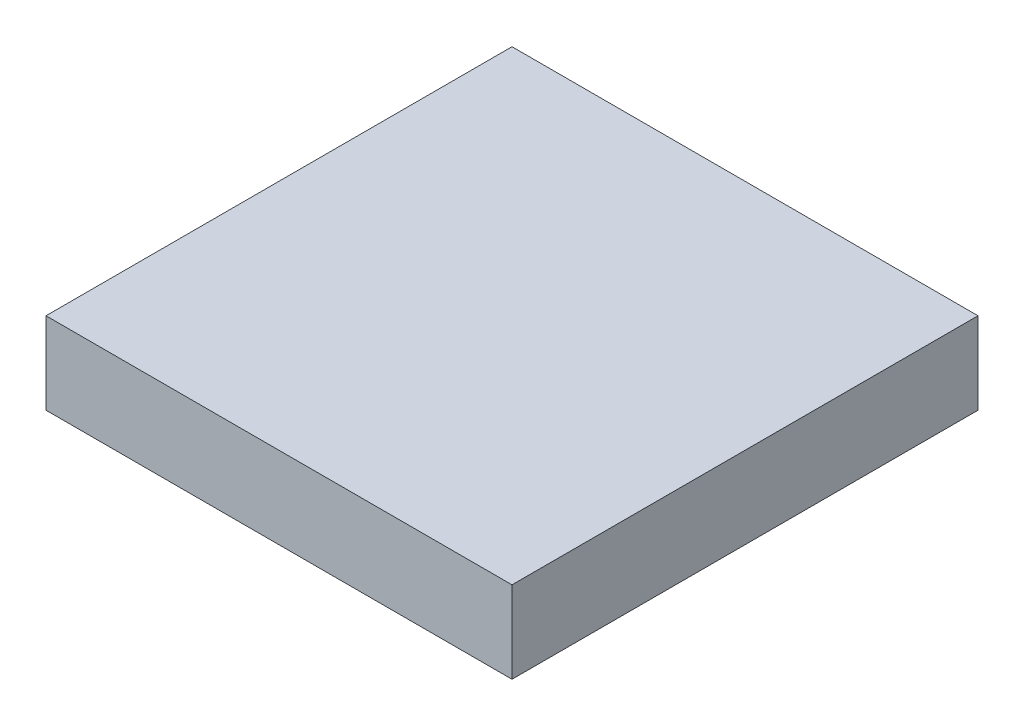
ISO-10303-21;
HEADER;
FILE_DESCRIPTION(('STEP AP214'),'2;1');
FILE_NAME('part.step','',(''),(''),'','','');
FILE_SCHEMA(('AUTOMOTIVE_DESIGN { 1 0 10303 214 1 1 1 1 }'));
ENDSEC;
DATA;
#1=APPLICATION_CONTEXT('core data for automotive mechanical design processes');
#2=APPLICATION_PROTOCOL_DEFINITION('international standard','automotive_design',2000,#1);
#3=PRODUCT_CONTEXT('',#1,'mechanical');
#4=PRODUCT('Part','Part','',(#3));
#5=PRODUCT_RELATED_PRODUCT_CATEGORY('part','',(#4));
#6=PRODUCT_DEFINITION_FORMATION('','',#4);
#7=PRODUCT_DEFINITION_CONTEXT('part definition',#1,'design');
#8=PRODUCT_DEFINITION('design','',#6,#7);
#9=PRODUCT_DEFINITION_SHAPE('','',#8);
#10=(LENGTH_UNIT() NAMED_UNIT(*) SI_UNIT(.MILLI.,.METRE.));
#11=(NAMED_UNIT(*) PLANE_ANGLE_UNIT() SI_UNIT($,.RADIAN.));
#12=(NAMED_UNIT(*) SI_UNIT($,.STERADIAN.) SOLID_ANGLE_UNIT());
#13=UNCERTAINTY_MEASURE_WITH_UNIT(LENGTH_MEASURE(1.E-05),#10,'distance_accuracy_value','');
#14=(GEOMETRIC_REPRESENTATION_CONTEXT(3) GLOBAL_UNCERTAINTY_ASSIGNED_CONTEXT((#13)) GLOBAL_UNIT_ASSIGNED_CONTEXT((#10,
#11,#12)) REPRESENTATION_CONTEXT('',''));
#15=CARTESIAN_POINT('',(0.,0.,0.));
#16=DIRECTION('',(0.,0.,1.));
#17=DIRECTION('',(1.,0.,0.));
#18=AXIS2_PLACEMENT_3D('',#15,#16,#17);
#19=CARTESIAN_POINT('',(0.,4.46,0.));
#20=DIRECTION('',(1.,0.,0.));
#21=DIRECTION('',(0.,0.,-1.));
#22=AXIS2_PLACEMENT_3D('',#19,#20,#21);
#23=PLANE('',#22);
#24=DIRECTION('',(0.,0.,1.));
#25=VECTOR('',#24,1.);
#26=CARTESIAN_POINT('',(0.,0.,0.));
#27=LINE('',#26,#25);
#28=CARTESIAN_POINT('',(0.,0.,0.));
#29=VERTEX_POINT('',#28);
#30=CARTESIAN_POINT('',(0.,0.,25.4));
#31=VERTEX_POINT('',#30);
#32=EDGE_CURVE('E107',#29,#31,#27,.T.);
#33=ORIENTED_EDGE('',*,*,#32,.T.);
#34=DIRECTION('',(0.,-1.,0.));
#35=VECTOR('',#34,1.);
#36=CARTESIAN_POINT('',(0.,4.46,25.4));
#37=LINE('',#36,#35);
#38=CARTESIAN_POINT('',(0.,4.46,25.4));
#39=VERTEX_POINT('',#38);
#40=EDGE_CURVE('E11',#39,#31,#37,.T.);
#41=ORIENTED_EDGE('',*,*,#40,.F.);
#42=DIRECTION('',(0.,0.,1.));
#43=VECTOR('',#42,1.);
#44=CARTESIAN_POINT('',(0.,4.46,0.));
#45=LINE('',#44,#43);
#46=CARTESIAN_POINT('',(0.,4.46,0.));
#47=VERTEX_POINT('',#46);
#48=EDGE_CURVE('E91',#47,#39,#45,.T.);
#49=ORIENTED_EDGE('',*,*,#48,.F.);
#50=DIRECTION('',(0.,-1.,0.));
#51=VECTOR('',#50,1.);
#52=CARTESIAN_POINT('',(0.,4.46,0.));
#53=LINE('',#52,#51);
#54=EDGE_CURVE('E103',#47,#29,#53,.T.);
#55=ORIENTED_EDGE('',*,*,#54,.T.);
#56=EDGE_LOOP('',(#33,#41,#49,#55));
#57=FACE_BOUND('',#56,.T.);
#58=ADVANCED_FACE('F39',(#57),#23,.F.);
#59=CARTESIAN_POINT('',(0.,4.46,25.4));
#60=DIRECTION('',(0.,0.,-1.));
#61=DIRECTION('',(-1.,0.,0.));
#62=AXIS2_PLACEMENT_3D('',#59,#60,#61);
#63=PLANE('',#62);
#64=DIRECTION('',(1.,0.,0.));
#65=VECTOR('',#64,1.);
#66=CARTESIAN_POINT('',(0.,0.,25.4));
#67=LINE('',#66,#65);
#68=CARTESIAN_POINT('',(25.4,0.,25.4));
#69=VERTEX_POINT('',#68);
#70=EDGE_CURVE('E96',#31,#69,#67,.T.);
#71=ORIENTED_EDGE('',*,*,#70,.T.);
#72=DIRECTION('',(0.,-1.,0.));
#73=VECTOR('',#72,1.);
#74=CARTESIAN_POINT('',(25.4,4.46,25.4));
#75=LINE('',#74,#73);
#76=CARTESIAN_POINT('',(25.4,4.46,25.4));
#77=VERTEX_POINT('',#76);
#78=EDGE_CURVE('E48',#77,#69,#75,.T.);
#79=ORIENTED_EDGE('',*,*,#78,.F.);
#80=DIRECTION('',(1.,0.,0.));
#81=VECTOR('',#80,1.);
#82=CARTESIAN_POINT('',(0.,4.46,25.4));
#83=LINE('',#82,#81);
#84=EDGE_CURVE('E86',#39,#77,#83,.T.);
#85=ORIENTED_EDGE('',*,*,#84,.F.);
#86=ORIENTED_EDGE('',*,*,#40,.T.);
#87=EDGE_LOOP('',(#71,#79,#85,#86));
#88=FACE_BOUND('',#87,.T.);
#89=ADVANCED_FACE('F95',(#88),#63,.F.);
#90=CARTESIAN_POINT('',(25.4,4.46,0.));
#91=DIRECTION('',(-1.,0.,0.));
#92=DIRECTION('',(0.,0.,1.));
#93=AXIS2_PLACEMENT_3D('',#90,#91,#92);
#94=PLANE('',#93);
#95=DIRECTION('',(0.,0.,-1.));
#96=VECTOR('',#95,1.);
#97=CARTESIAN_POINT('',(25.4,0.,0.));
#98=LINE('',#97,#96);
#99=CARTESIAN_POINT('',(25.4,0.,0.));
#100=VERTEX_POINT('',#99);
#101=EDGE_CURVE('E73',#69,#100,#98,.T.);
#102=ORIENTED_EDGE('',*,*,#101,.T.);
#103=DIRECTION('',(0.,-1.,0.));
#104=VECTOR('',#103,1.);
#105=CARTESIAN_POINT('',(25.4,4.46,0.));
#106=LINE('',#105,#104);
#107=CARTESIAN_POINT('',(25.4,4.46,0.));
#108=VERTEX_POINT('',#107);
#109=EDGE_CURVE('E98',#108,#100,#106,.T.);
#110=ORIENTED_EDGE('',*,*,#109,.F.);
#111=DIRECTION('',(0.,0.,-1.));
#112=VECTOR('',#111,1.);
#113=CARTESIAN_POINT('',(25.4,4.46,0.));
#114=LINE('',#113,#112);
#115=EDGE_CURVE('E89',#77,#108,#114,.T.);
#116=ORIENTED_EDGE('',*,*,#115,.F.);
#117=ORIENTED_EDGE('',*,*,#78,.T.);
#118=EDGE_LOOP('',(#102,#110,#116,#117));
#119=FACE_BOUND('',#118,.T.);
#120=ADVANCED_FACE('F99',(#119),#94,.F.);
#121=CARTESIAN_POINT('',(0.,4.46,0.));
#122=DIRECTION('',(0.,0.,1.));
#123=DIRECTION('',(1.,0.,0.));
#124=AXIS2_PLACEMENT_3D('',#121,#122,#123);
#125=PLANE('',#124);
#126=DIRECTION('',(-1.,0.,0.));
#127=VECTOR('',#126,1.);
#128=CARTESIAN_POINT('',(0.,0.,0.));
#129=LINE('',#128,#127);
#130=EDGE_CURVE('E79',#100,#29,#129,.T.);
#131=ORIENTED_EDGE('',*,*,#130,.T.);
#132=ORIENTED_EDGE('',*,*,#54,.F.);
#133=DIRECTION('',(-1.,0.,0.));
#134=VECTOR('',#133,1.);
#135=CARTESIAN_POINT('',(0.,4.46,0.));
#136=LINE('',#135,#134);
#137=EDGE_CURVE('E56',#108,#47,#136,.T.);
#138=ORIENTED_EDGE('',*,*,#137,.F.);
#139=ORIENTED_EDGE('',*,*,#109,.T.);
#140=EDGE_LOOP('',(#131,#132,#138,#139));
#141=FACE_BOUND('',#140,.T.);
#142=ADVANCED_FACE('F120',(#141),#125,.F.);
#143=CARTESIAN_POINT('',(0.,4.46,0.));
#144=DIRECTION('',(0.,1.,0.));
#145=DIRECTION('',(0.,0.,1.));
#146=AXIS2_PLACEMENT_3D('',#143,#144,#145);
#147=PLANE('',#146);
#148=ORIENTED_EDGE('',*,*,#48,.T.);
#149=ORIENTED_EDGE('',*,*,#84,.T.);
#150=ORIENTED_EDGE('',*,*,#115,.T.);
#151=ORIENTED_EDGE('',*,*,#137,.T.);
#152=EDGE_LOOP('',(#148,#149,#150,#151));
#153=FACE_BOUND('',#152,.T.);
#154=ADVANCED_FACE('F87',(#153),#147,.T.);
#155=CARTESIAN_POINT('',(0.,0.,0.));
#156=DIRECTION('',(0.,1.,0.));
#157=DIRECTION('',(0.,0.,1.));
#158=AXIS2_PLACEMENT_3D('',#155,#156,#157);
#159=PLANE('',#158);
#160=ORIENTED_EDGE('',*,*,#32,.F.);
#161=ORIENTED_EDGE('',*,*,#130,.F.);
#162=ORIENTED_EDGE('',*,*,#101,.F.);
#163=ORIENTED_EDGE('',*,*,#70,.F.);
#164=EDGE_LOOP('',(#160,#161,#162,#163));
#165=FACE_BOUND('',#164,.T.);
#166=ADVANCED_FACE('F123',(#165),#159,.F.);
#167=CLOSED_SHELL('',(#58,#89,#120,#142,#154,#166));
#168=MANIFOLD_SOLID_BREP('B2',#167);
#169=ADVANCED_BREP_SHAPE_REPRESENTATION('',(#18,#168),#14);
#170=SHAPE_DEFINITION_REPRESENTATION(#9,#169);
ENDSEC;
END-ISO-10303-21;
